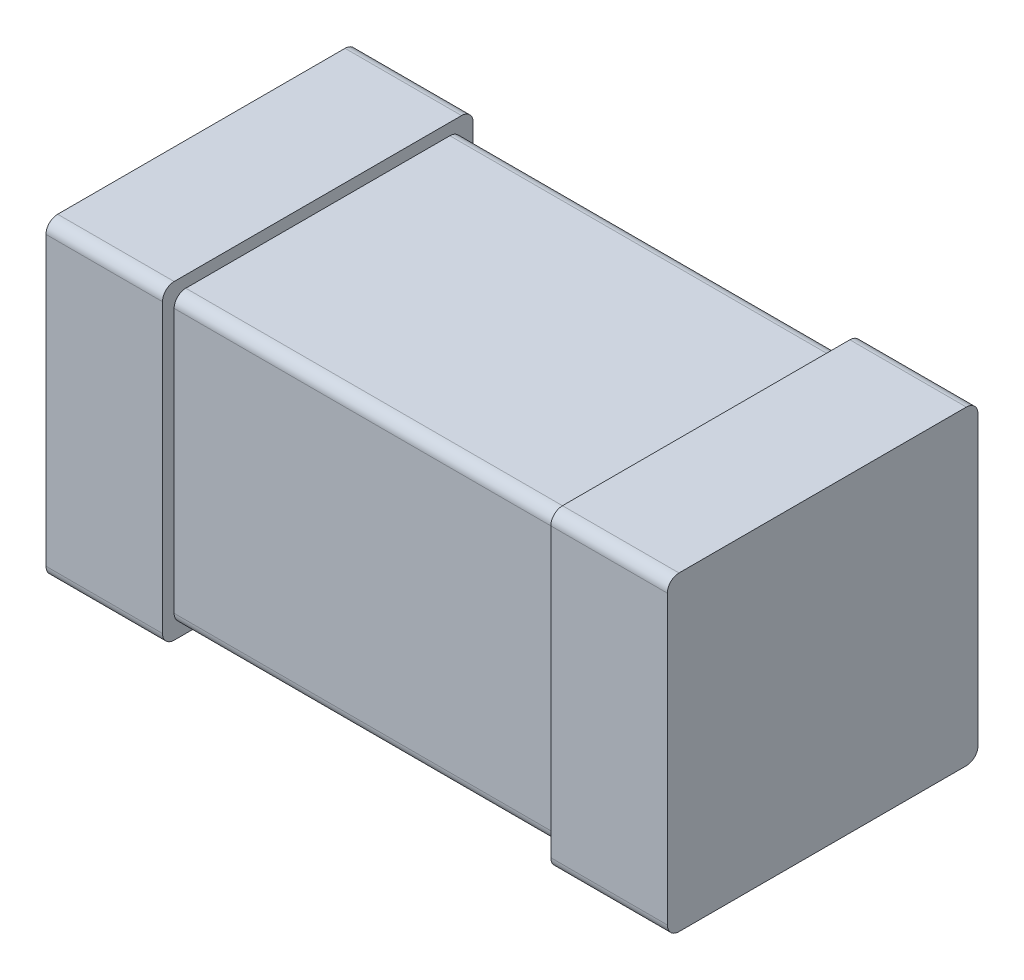
ISO-10303-21;
HEADER;
FILE_DESCRIPTION(('STEP AP214'),'2;1');
FILE_NAME('part.step','',(''),(''),'','','');
FILE_SCHEMA(('AUTOMOTIVE_DESIGN { 1 0 10303 214 1 1 1 1 }'));
ENDSEC;
DATA;
#1=APPLICATION_CONTEXT('core data for automotive mechanical design processes');
#2=APPLICATION_PROTOCOL_DEFINITION('international standard','automotive_design',2000,#1);
#3=PRODUCT_CONTEXT('',#1,'mechanical');
#4=PRODUCT('Part','Part','',(#3));
#5=PRODUCT_RELATED_PRODUCT_CATEGORY('part','',(#4));
#6=PRODUCT_DEFINITION_FORMATION('','',#4);
#7=PRODUCT_DEFINITION_CONTEXT('part definition',#1,'design');
#8=PRODUCT_DEFINITION('design','',#6,#7);
#9=PRODUCT_DEFINITION_SHAPE('','',#8);
#10=(LENGTH_UNIT() NAMED_UNIT(*) SI_UNIT(.MILLI.,.METRE.));
#11=(NAMED_UNIT(*) PLANE_ANGLE_UNIT() SI_UNIT($,.RADIAN.));
#12=(NAMED_UNIT(*) SI_UNIT($,.STERADIAN.) SOLID_ANGLE_UNIT());
#13=UNCERTAINTY_MEASURE_WITH_UNIT(LENGTH_MEASURE(1.E-05),#10,'distance_accuracy_value','');
#14=(GEOMETRIC_REPRESENTATION_CONTEXT(3) GLOBAL_UNCERTAINTY_ASSIGNED_CONTEXT((#13)) GLOBAL_UNIT_ASSIGNED_CONTEXT((#10,
#11,#12)) REPRESENTATION_CONTEXT('',''));
#15=CARTESIAN_POINT('',(0.,0.,0.));
#16=DIRECTION('',(0.,0.,1.));
#17=DIRECTION('',(1.,0.,0.));
#18=AXIS2_PLACEMENT_3D('',#15,#16,#17);
#19=CARTESIAN_POINT('',(0.8,-0.4,0.));
#20=DIRECTION('',(1.,0.,0.));
#21=DIRECTION('',(0.,1.,0.));
#22=AXIS2_PLACEMENT_3D('',#19,#20,#21);
#23=PLANE('',#22);
#24=DIRECTION('',(0.,0.,1.));
#25=VECTOR('',#24,1.);
#26=CARTESIAN_POINT('',(0.8,-0.4,0.));
#27=LINE('',#26,#25);
#28=CARTESIAN_POINT('',(0.8,-0.4,0.03));
#29=VERTEX_POINT('',#28);
#30=CARTESIAN_POINT('',(0.8,-0.4,0.77));
#31=VERTEX_POINT('',#30);
#32=EDGE_CURVE('E373',#29,#31,#27,.T.);
#33=ORIENTED_EDGE('',*,*,#32,.F.);
#34=CARTESIAN_POINT('',(0.8,-0.37,0.03));
#35=DIRECTION('',(1.,0.,0.));
#36=DIRECTION('',(0.,0.,1.));
#37=AXIS2_PLACEMENT_3D('',#34,#35,#36);
#38=CIRCLE('',#37,0.03);
#39=CARTESIAN_POINT('',(0.8,-0.37,0.));
#40=VERTEX_POINT('',#39);
#41=EDGE_CURVE('E440',#29,#40,#38,.T.);
#42=ORIENTED_EDGE('',*,*,#41,.T.);
#43=DIRECTION('',(0.,1.,0.));
#44=VECTOR('',#43,1.);
#45=CARTESIAN_POINT('',(0.8,-0.4,0.));
#46=LINE('',#45,#44);
#47=CARTESIAN_POINT('',(0.8,0.37,0.));
#48=VERTEX_POINT('',#47);
#49=EDGE_CURVE('E401',#40,#48,#46,.T.);
#50=ORIENTED_EDGE('',*,*,#49,.T.);
#51=CARTESIAN_POINT('',(0.8,0.37,0.03));
#52=DIRECTION('',(-1.,0.,0.));
#53=DIRECTION('',(0.,0.,1.));
#54=AXIS2_PLACEMENT_3D('',#51,#52,#53);
#55=CIRCLE('',#54,0.03);
#56=CARTESIAN_POINT('',(0.8,0.4,0.03));
#57=VERTEX_POINT('',#56);
#58=EDGE_CURVE('E298',#57,#48,#55,.T.);
#59=ORIENTED_EDGE('',*,*,#58,.F.);
#60=DIRECTION('',(0.,0.,1.));
#61=VECTOR('',#60,1.);
#62=CARTESIAN_POINT('',(0.8,0.4,0.));
#63=LINE('',#62,#61);
#64=CARTESIAN_POINT('',(0.8,0.4,0.77));
#65=VERTEX_POINT('',#64);
#66=EDGE_CURVE('E11',#57,#65,#63,.T.);
#67=ORIENTED_EDGE('',*,*,#66,.T.);
#68=CARTESIAN_POINT('',(0.8,0.37,0.77));
#69=DIRECTION('',(1.,0.,0.));
#70=DIRECTION('',(0.,0.,1.));
#71=AXIS2_PLACEMENT_3D('',#68,#69,#70);
#72=CIRCLE('',#71,0.03);
#73=CARTESIAN_POINT('',(0.8,0.37,0.8));
#74=VERTEX_POINT('',#73);
#75=EDGE_CURVE('E348',#65,#74,#72,.T.);
#76=ORIENTED_EDGE('',*,*,#75,.T.);
#77=DIRECTION('',(0.,1.,0.));
#78=VECTOR('',#77,1.);
#79=CARTESIAN_POINT('',(0.8,-0.4,0.8));
#80=LINE('',#79,#78);
#81=CARTESIAN_POINT('',(0.8,-0.37,0.8));
#82=VERTEX_POINT('',#81);
#83=EDGE_CURVE('E377',#82,#74,#80,.T.);
#84=ORIENTED_EDGE('',*,*,#83,.F.);
#85=CARTESIAN_POINT('',(0.8,-0.37,0.77));
#86=DIRECTION('',(-1.,0.,0.));
#87=DIRECTION('',(0.,0.,1.));
#88=AXIS2_PLACEMENT_3D('',#85,#86,#87);
#89=CIRCLE('',#88,0.03);
#90=EDGE_CURVE('E237',#31,#82,#89,.T.);
#91=ORIENTED_EDGE('',*,*,#90,.F.);
#92=EDGE_LOOP('',(#33,#42,#50,#59,#67,#76,#84,#91));
#93=FACE_BOUND('',#92,.T.);
#94=ADVANCED_FACE('F17',(#93),#23,.T.);
#95=CARTESIAN_POINT('',(0.5,0.4,0.));
#96=DIRECTION('',(0.,1.,0.));
#97=DIRECTION('',(1.,0.,0.));
#98=AXIS2_PLACEMENT_3D('',#95,#96,#97);
#99=PLANE('',#98);
#100=ORIENTED_EDGE('',*,*,#66,.F.);
#101=DIRECTION('',(1.,0.,0.));
#102=VECTOR('',#101,1.);
#103=CARTESIAN_POINT('',(0.5,0.4,0.03));
#104=LINE('',#103,#102);
#105=CARTESIAN_POINT('',(0.5,0.4,0.03));
#106=VERTEX_POINT('',#105);
#107=EDGE_CURVE('E294',#106,#57,#104,.T.);
#108=ORIENTED_EDGE('',*,*,#107,.F.);
#109=DIRECTION('',(0.,0.,1.));
#110=VECTOR('',#109,1.);
#111=CARTESIAN_POINT('',(0.5,0.4,0.));
#112=LINE('',#111,#110);
#113=CARTESIAN_POINT('',(0.5,0.4,0.77));
#114=VERTEX_POINT('',#113);
#115=EDGE_CURVE('E335',#106,#114,#112,.T.);
#116=ORIENTED_EDGE('',*,*,#115,.T.);
#117=DIRECTION('',(1.,0.,0.));
#118=VECTOR('',#117,1.);
#119=CARTESIAN_POINT('',(0.5,0.4,0.77));
#120=LINE('',#119,#118);
#121=EDGE_CURVE('E28',#114,#65,#120,.T.);
#122=ORIENTED_EDGE('',*,*,#121,.T.);
#123=EDGE_LOOP('',(#100,#108,#116,#122));
#124=FACE_BOUND('',#123,.T.);
#125=ADVANCED_FACE('F630',(#124),#99,.T.);
#126=CARTESIAN_POINT('',(0.5,0.37,0.77));
#127=DIRECTION('',(1.,0.,0.));
#128=DIRECTION('',(0.,1.,0.));
#129=AXIS2_PLACEMENT_3D('',#126,#127,#128);
#130=CYLINDRICAL_SURFACE('',#129,0.03);
#131=CARTESIAN_POINT('',(0.5,0.37,0.77));
#132=DIRECTION('',(1.,0.,0.));
#133=DIRECTION('',(0.,0.,1.));
#134=AXIS2_PLACEMENT_3D('',#131,#132,#133);
#135=CIRCLE('',#134,0.03);
#136=CARTESIAN_POINT('',(0.5,0.37,0.8));
#137=VERTEX_POINT('',#136);
#138=EDGE_CURVE('E339',#114,#137,#135,.T.);
#139=ORIENTED_EDGE('',*,*,#138,.T.);
#140=DIRECTION('',(1.,0.,0.));
#141=VECTOR('',#140,1.);
#142=CARTESIAN_POINT('',(0.5,0.37,0.8));
#143=LINE('',#142,#141);
#144=EDGE_CURVE('E299',#137,#74,#143,.T.);
#145=ORIENTED_EDGE('',*,*,#144,.T.);
#146=ORIENTED_EDGE('',*,*,#75,.F.);
#147=ORIENTED_EDGE('',*,*,#121,.F.);
#148=EDGE_LOOP('',(#139,#145,#146,#147));
#149=FACE_BOUND('',#148,.T.);
#150=ADVANCED_FACE('F646',(#149),#130,.T.);
#151=CARTESIAN_POINT('',(0.5,0.37,0.03));
#152=DIRECTION('',(1.,0.,0.));
#153=DIRECTION('',(0.,1.,0.));
#154=AXIS2_PLACEMENT_3D('',#151,#152,#153);
#155=CYLINDRICAL_SURFACE('',#154,0.03);
#156=ORIENTED_EDGE('',*,*,#107,.T.);
#157=ORIENTED_EDGE('',*,*,#58,.T.);
#158=DIRECTION('',(1.,0.,0.));
#159=VECTOR('',#158,1.);
#160=CARTESIAN_POINT('',(0.5,0.37,0.));
#161=LINE('',#160,#159);
#162=CARTESIAN_POINT('',(0.5,0.37,0.));
#163=VERTEX_POINT('',#162);
#164=EDGE_CURVE('E328',#163,#48,#161,.T.);
#165=ORIENTED_EDGE('',*,*,#164,.F.);
#166=CARTESIAN_POINT('',(0.5,0.37,0.03));
#167=DIRECTION('',(-1.,0.,0.));
#168=DIRECTION('',(0.,0.,1.));
#169=AXIS2_PLACEMENT_3D('',#166,#167,#168);
#170=CIRCLE('',#169,0.03);
#171=EDGE_CURVE('E311',#106,#163,#170,.T.);
#172=ORIENTED_EDGE('',*,*,#171,.F.);
#173=EDGE_LOOP('',(#156,#157,#165,#172));
#174=FACE_BOUND('',#173,.T.);
#175=ADVANCED_FACE('F555',(#174),#155,.T.);
#176=CARTESIAN_POINT('',(0.5,-0.4,0.8));
#177=DIRECTION('',(0.,0.,1.));
#178=DIRECTION('',(1.,0.,0.));
#179=AXIS2_PLACEMENT_3D('',#176,#177,#178);
#180=PLANE('',#179);
#181=DIRECTION('',(0.,1.,0.));
#182=VECTOR('',#181,1.);
#183=CARTESIAN_POINT('',(0.5,-0.4,0.8));
#184=LINE('',#183,#182);
#185=CARTESIAN_POINT('',(0.5,-0.37,0.8));
#186=VERTEX_POINT('',#185);
#187=EDGE_CURVE('E250',#186,#137,#184,.T.);
#188=ORIENTED_EDGE('',*,*,#187,.F.);
#189=DIRECTION('',(1.,0.,0.));
#190=VECTOR('',#189,1.);
#191=CARTESIAN_POINT('',(0.5,-0.37,0.8));
#192=LINE('',#191,#190);
#193=EDGE_CURVE('E324',#186,#82,#192,.T.);
#194=ORIENTED_EDGE('',*,*,#193,.T.);
#195=ORIENTED_EDGE('',*,*,#83,.T.);
#196=ORIENTED_EDGE('',*,*,#144,.F.);
#197=EDGE_LOOP('',(#188,#194,#195,#196));
#198=FACE_BOUND('',#197,.T.);
#199=ADVANCED_FACE('F549',(#198),#180,.T.);
#200=CARTESIAN_POINT('',(0.5,-0.4,0.));
#201=DIRECTION('',(0.,0.,1.));
#202=DIRECTION('',(1.,0.,0.));
#203=AXIS2_PLACEMENT_3D('',#200,#201,#202);
#204=PLANE('',#203);
#205=ORIENTED_EDGE('',*,*,#164,.T.);
#206=ORIENTED_EDGE('',*,*,#49,.F.);
#207=DIRECTION('',(1.,0.,0.));
#208=VECTOR('',#207,1.);
#209=CARTESIAN_POINT('',(0.5,-0.37,0.));
#210=LINE('',#209,#208);
#211=CARTESIAN_POINT('',(0.5,-0.37,0.));
#212=VERTEX_POINT('',#211);
#213=EDGE_CURVE('E444',#212,#40,#210,.T.);
#214=ORIENTED_EDGE('',*,*,#213,.F.);
#215=DIRECTION('',(0.,1.,0.));
#216=VECTOR('',#215,1.);
#217=CARTESIAN_POINT('',(0.5,-0.4,0.));
#218=LINE('',#217,#216);
#219=EDGE_CURVE('E306',#212,#163,#218,.T.);
#220=ORIENTED_EDGE('',*,*,#219,.T.);
#221=EDGE_LOOP('',(#205,#206,#214,#220));
#222=FACE_BOUND('',#221,.T.);
#223=ADVANCED_FACE('F554',(#222),#204,.F.);
#224=CARTESIAN_POINT('',(0.5,-0.37,0.77));
#225=DIRECTION('',(1.,0.,0.));
#226=DIRECTION('',(0.,-1.,0.));
#227=AXIS2_PLACEMENT_3D('',#224,#225,#226);
#228=CYLINDRICAL_SURFACE('',#227,0.03);
#229=DIRECTION('',(1.,0.,0.));
#230=VECTOR('',#229,1.);
#231=CARTESIAN_POINT('',(0.5,-0.4,0.77));
#232=LINE('',#231,#230);
#233=CARTESIAN_POINT('',(0.5,-0.4,0.77));
#234=VERTEX_POINT('',#233);
#235=EDGE_CURVE('E359',#234,#31,#232,.T.);
#236=ORIENTED_EDGE('',*,*,#235,.T.);
#237=ORIENTED_EDGE('',*,*,#90,.T.);
#238=ORIENTED_EDGE('',*,*,#193,.F.);
#239=CARTESIAN_POINT('',(0.5,-0.37,0.77));
#240=DIRECTION('',(-1.,0.,0.));
#241=DIRECTION('',(0.,0.,1.));
#242=AXIS2_PLACEMENT_3D('',#239,#240,#241);
#243=CIRCLE('',#242,0.03);
#244=EDGE_CURVE('E209',#234,#186,#243,.T.);
#245=ORIENTED_EDGE('',*,*,#244,.F.);
#246=EDGE_LOOP('',(#236,#237,#238,#245));
#247=FACE_BOUND('',#246,.T.);
#248=ADVANCED_FACE('F618',(#247),#228,.T.);
#249=CARTESIAN_POINT('',(0.5,-0.37,0.03));
#250=DIRECTION('',(1.,0.,0.));
#251=DIRECTION('',(0.,-1.,0.));
#252=AXIS2_PLACEMENT_3D('',#249,#250,#251);
#253=CYLINDRICAL_SURFACE('',#252,0.03);
#254=CARTESIAN_POINT('',(0.5,-0.37,0.03));
#255=DIRECTION('',(1.,0.,0.));
#256=DIRECTION('',(0.,0.,1.));
#257=AXIS2_PLACEMENT_3D('',#254,#255,#256);
#258=CIRCLE('',#257,0.03);
#259=CARTESIAN_POINT('',(0.5,-0.4,0.03));
#260=VERTEX_POINT('',#259);
#261=EDGE_CURVE('E310',#260,#212,#258,.T.);
#262=ORIENTED_EDGE('',*,*,#261,.T.);
#263=ORIENTED_EDGE('',*,*,#213,.T.);
#264=ORIENTED_EDGE('',*,*,#41,.F.);
#265=DIRECTION('',(1.,0.,0.));
#266=VECTOR('',#265,1.);
#267=CARTESIAN_POINT('',(0.5,-0.4,0.03));
#268=LINE('',#267,#266);
#269=EDGE_CURVE('E369',#260,#29,#268,.T.);
#270=ORIENTED_EDGE('',*,*,#269,.F.);
#271=EDGE_LOOP('',(#262,#263,#264,#270));
#272=FACE_BOUND('',#271,.T.);
#273=ADVANCED_FACE('F612',(#272),#253,.T.);
#274=CARTESIAN_POINT('',(0.5,-0.4,0.));
#275=DIRECTION('',(0.,1.,0.));
#276=DIRECTION('',(1.,0.,0.));
#277=AXIS2_PLACEMENT_3D('',#274,#275,#276);
#278=PLANE('',#277);
#279=ORIENTED_EDGE('',*,*,#235,.F.);
#280=DIRECTION('',(0.,0.,1.));
#281=VECTOR('',#280,1.);
#282=CARTESIAN_POINT('',(0.5,-0.4,0.));
#283=LINE('',#282,#281);
#284=EDGE_CURVE('E323',#260,#234,#283,.T.);
#285=ORIENTED_EDGE('',*,*,#284,.F.);
#286=ORIENTED_EDGE('',*,*,#269,.T.);
#287=ORIENTED_EDGE('',*,*,#32,.T.);
#288=EDGE_LOOP('',(#279,#285,#286,#287));
#289=FACE_BOUND('',#288,.T.);
#290=ADVANCED_FACE('F617',(#289),#278,.F.);
#291=CARTESIAN_POINT('',(0.5,-0.4,0.));
#292=DIRECTION('',(1.,0.,0.));
#293=DIRECTION('',(0.,1.,0.));
#294=AXIS2_PLACEMENT_3D('',#291,#292,#293);
#295=PLANE('',#294);
#296=DIRECTION('',(0.,1.,0.));
#297=VECTOR('',#296,1.);
#298=CARTESIAN_POINT('',(0.5,-0.37,0.03));
#299=LINE('',#298,#297);
#300=CARTESIAN_POINT('',(0.5,-0.34,0.03));
#301=VERTEX_POINT('',#300);
#302=CARTESIAN_POINT('',(0.5,0.34,0.03));
#303=VERTEX_POINT('',#302);
#304=EDGE_CURVE('E394',#301,#303,#299,.T.);
#305=ORIENTED_EDGE('',*,*,#304,.T.);
#306=CARTESIAN_POINT('',(0.5,0.34,0.06));
#307=DIRECTION('',(-1.,0.,0.));
#308=DIRECTION('',(0.,0.,1.));
#309=AXIS2_PLACEMENT_3D('',#306,#307,#308);
#310=CIRCLE('',#309,0.03);
#311=CARTESIAN_POINT('',(0.5,0.37,0.06));
#312=VERTEX_POINT('',#311);
#313=EDGE_CURVE('E384',#312,#303,#310,.T.);
#314=ORIENTED_EDGE('',*,*,#313,.F.);
#315=DIRECTION('',(0.,0.,1.));
#316=VECTOR('',#315,1.);
#317=CARTESIAN_POINT('',(0.5,0.37,0.03));
#318=LINE('',#317,#316);
#319=CARTESIAN_POINT('',(0.5,0.37,0.74));
#320=VERTEX_POINT('',#319);
#321=EDGE_CURVE('E256',#312,#320,#318,.T.);
#322=ORIENTED_EDGE('',*,*,#321,.T.);
#323=CARTESIAN_POINT('',(0.5,0.34,0.74));
#324=DIRECTION('',(1.,0.,0.));
#325=DIRECTION('',(0.,0.,1.));
#326=AXIS2_PLACEMENT_3D('',#323,#324,#325);
#327=CIRCLE('',#326,0.03);
#328=CARTESIAN_POINT('',(0.5,0.34,0.77));
#329=VERTEX_POINT('',#328);
#330=EDGE_CURVE('E240',#320,#329,#327,.T.);
#331=ORIENTED_EDGE('',*,*,#330,.T.);
#332=DIRECTION('',(0.,1.,0.));
#333=VECTOR('',#332,1.);
#334=CARTESIAN_POINT('',(0.5,-0.37,0.77));
#335=LINE('',#334,#333);
#336=CARTESIAN_POINT('',(0.5,-0.34,0.77));
#337=VERTEX_POINT('',#336);
#338=EDGE_CURVE('E217',#337,#329,#335,.T.);
#339=ORIENTED_EDGE('',*,*,#338,.F.);
#340=CARTESIAN_POINT('',(0.5,-0.34,0.74));
#341=DIRECTION('',(-1.,0.,0.));
#342=DIRECTION('',(0.,0.,1.));
#343=AXIS2_PLACEMENT_3D('',#340,#341,#342);
#344=CIRCLE('',#343,0.03);
#345=CARTESIAN_POINT('',(0.5,-0.37,0.74));
#346=VERTEX_POINT('',#345);
#347=EDGE_CURVE('E210',#346,#337,#344,.T.);
#348=ORIENTED_EDGE('',*,*,#347,.F.);
#349=DIRECTION('',(0.,0.,1.));
#350=VECTOR('',#349,1.);
#351=CARTESIAN_POINT('',(0.5,-0.37,0.03));
#352=LINE('',#351,#350);
#353=CARTESIAN_POINT('',(0.5,-0.37,0.06));
#354=VERTEX_POINT('',#353);
#355=EDGE_CURVE('E197',#354,#346,#352,.T.);
#356=ORIENTED_EDGE('',*,*,#355,.F.);
#357=CARTESIAN_POINT('',(0.5,-0.34,0.06));
#358=DIRECTION('',(1.,0.,0.));
#359=DIRECTION('',(0.,0.,1.));
#360=AXIS2_PLACEMENT_3D('',#357,#358,#359);
#361=CIRCLE('',#360,0.03);
#362=EDGE_CURVE('E21',#354,#301,#361,.T.);
#363=ORIENTED_EDGE('',*,*,#362,.T.);
#364=EDGE_LOOP('',(#305,#314,#322,#331,#339,#348,#356,#363));
#365=FACE_BOUND('',#364,.T.);
#366=ORIENTED_EDGE('',*,*,#244,.T.);
#367=ORIENTED_EDGE('',*,*,#187,.T.);
#368=ORIENTED_EDGE('',*,*,#138,.F.);
#369=ORIENTED_EDGE('',*,*,#115,.F.);
#370=ORIENTED_EDGE('',*,*,#171,.T.);
#371=ORIENTED_EDGE('',*,*,#219,.F.);
#372=ORIENTED_EDGE('',*,*,#261,.F.);
#373=ORIENTED_EDGE('',*,*,#284,.T.);
#374=EDGE_LOOP('',(#366,#367,#368,#369,#370,#371,#372,#373));
#375=FACE_BOUND('',#374,.T.);
#376=ADVANCED_FACE('F214',(#365,#375),#295,.F.);
#377=CARTESIAN_POINT('',(-0.5,-0.37,0.03));
#378=DIRECTION('',(0.,1.,0.));
#379=DIRECTION('',(1.,0.,0.));
#380=AXIS2_PLACEMENT_3D('',#377,#378,#379);
#381=PLANE('',#380);
#382=DIRECTION('',(1.,0.,0.));
#383=VECTOR('',#382,1.);
#384=CARTESIAN_POINT('',(-0.5,-0.37,0.74));
#385=LINE('',#384,#383);
#386=CARTESIAN_POINT('',(-0.5,-0.37,0.74));
#387=VERTEX_POINT('',#386);
#388=EDGE_CURVE('E202',#387,#346,#385,.T.);
#389=ORIENTED_EDGE('',*,*,#388,.F.);
#390=DIRECTION('',(0.,0.,1.));
#391=VECTOR('',#390,1.);
#392=CARTESIAN_POINT('',(-0.5,-0.37,0.03));
#393=LINE('',#392,#391);
#394=CARTESIAN_POINT('',(-0.5,-0.37,0.06));
#395=VERTEX_POINT('',#394);
#396=EDGE_CURVE('E278',#395,#387,#393,.T.);
#397=ORIENTED_EDGE('',*,*,#396,.F.);
#398=DIRECTION('',(1.,0.,0.));
#399=VECTOR('',#398,1.);
#400=CARTESIAN_POINT('',(-0.5,-0.37,0.06));
#401=LINE('',#400,#399);
#402=EDGE_CURVE('E204',#395,#354,#401,.T.);
#403=ORIENTED_EDGE('',*,*,#402,.T.);
#404=ORIENTED_EDGE('',*,*,#355,.T.);
#405=EDGE_LOOP('',(#389,#397,#403,#404));
#406=FACE_BOUND('',#405,.T.);
#407=ADVANCED_FACE('F199',(#406),#381,.F.);
#408=CARTESIAN_POINT('',(-0.5,-0.34,0.74));
#409=DIRECTION('',(1.,0.,0.));
#410=DIRECTION('',(0.,-1.,0.));
#411=AXIS2_PLACEMENT_3D('',#408,#409,#410);
#412=CYLINDRICAL_SURFACE('',#411,0.03);
#413=ORIENTED_EDGE('',*,*,#388,.T.);
#414=ORIENTED_EDGE('',*,*,#347,.T.);
#415=DIRECTION('',(1.,0.,0.));
#416=VECTOR('',#415,1.);
#417=CARTESIAN_POINT('',(-0.5,-0.34,0.77));
#418=LINE('',#417,#416);
#419=CARTESIAN_POINT('',(-0.5,-0.34,0.77));
#420=VERTEX_POINT('',#419);
#421=EDGE_CURVE('E233',#420,#337,#418,.T.);
#422=ORIENTED_EDGE('',*,*,#421,.F.);
#423=CARTESIAN_POINT('',(-0.5,-0.34,0.74));
#424=DIRECTION('',(-1.,0.,0.));
#425=DIRECTION('',(0.,0.,1.));
#426=AXIS2_PLACEMENT_3D('',#423,#424,#425);
#427=CIRCLE('',#426,0.03);
#428=EDGE_CURVE('E225',#387,#420,#427,.T.);
#429=ORIENTED_EDGE('',*,*,#428,.F.);
#430=EDGE_LOOP('',(#413,#414,#422,#429));
#431=FACE_BOUND('',#430,.T.);
#432=ADVANCED_FACE('F223',(#431),#412,.T.);
#433=CARTESIAN_POINT('',(-0.5,-0.37,0.77));
#434=DIRECTION('',(0.,0.,1.));
#435=DIRECTION('',(1.,0.,0.));
#436=AXIS2_PLACEMENT_3D('',#433,#434,#435);
#437=PLANE('',#436);
#438=DIRECTION('',(0.,1.,0.));
#439=VECTOR('',#438,1.);
#440=CARTESIAN_POINT('',(-0.5,-0.37,0.77));
#441=LINE('',#440,#439);
#442=CARTESIAN_POINT('',(-0.5,0.34,0.77));
#443=VERTEX_POINT('',#442);
#444=EDGE_CURVE('E273',#420,#443,#441,.T.);
#445=ORIENTED_EDGE('',*,*,#444,.F.);
#446=ORIENTED_EDGE('',*,*,#421,.T.);
#447=ORIENTED_EDGE('',*,*,#338,.T.);
#448=DIRECTION('',(1.,0.,0.));
#449=VECTOR('',#448,1.);
#450=CARTESIAN_POINT('',(-0.5,0.34,0.77));
#451=LINE('',#450,#449);
#452=EDGE_CURVE('E255',#443,#329,#451,.T.);
#453=ORIENTED_EDGE('',*,*,#452,.F.);
#454=EDGE_LOOP('',(#445,#446,#447,#453));
#455=FACE_BOUND('',#454,.T.);
#456=ADVANCED_FACE('F653',(#455),#437,.T.);
#457=CARTESIAN_POINT('',(-0.5,0.34,0.74));
#458=DIRECTION('',(1.,0.,0.));
#459=DIRECTION('',(0.,1.,0.));
#460=AXIS2_PLACEMENT_3D('',#457,#458,#459);
#461=CYLINDRICAL_SURFACE('',#460,0.03);
#462=CARTESIAN_POINT('',(-0.5,0.34,0.74));
#463=DIRECTION('',(1.,0.,0.));
#464=DIRECTION('',(0.,0.,1.));
#465=AXIS2_PLACEMENT_3D('',#462,#463,#464);
#466=CIRCLE('',#465,0.03);
#467=CARTESIAN_POINT('',(-0.5,0.37,0.74));
#468=VERTEX_POINT('',#467);
#469=EDGE_CURVE('E269',#468,#443,#466,.T.);
#470=ORIENTED_EDGE('',*,*,#469,.T.);
#471=ORIENTED_EDGE('',*,*,#452,.T.);
#472=ORIENTED_EDGE('',*,*,#330,.F.);
#473=DIRECTION('',(1.,0.,0.));
#474=VECTOR('',#473,1.);
#475=CARTESIAN_POINT('',(-0.5,0.37,0.74));
#476=LINE('',#475,#474);
#477=EDGE_CURVE('E251',#468,#320,#476,.T.);
#478=ORIENTED_EDGE('',*,*,#477,.F.);
#479=EDGE_LOOP('',(#470,#471,#472,#478));
#480=FACE_BOUND('',#479,.T.);
#481=ADVANCED_FACE('F658',(#480),#461,.T.);
#482=CARTESIAN_POINT('',(-0.5,0.37,0.03));
#483=DIRECTION('',(0.,1.,0.));
#484=DIRECTION('',(1.,0.,0.));
#485=AXIS2_PLACEMENT_3D('',#482,#483,#484);
#486=PLANE('',#485);
#487=ORIENTED_EDGE('',*,*,#321,.F.);
#488=DIRECTION('',(1.,0.,0.));
#489=VECTOR('',#488,1.);
#490=CARTESIAN_POINT('',(-0.5,0.37,0.06));
#491=LINE('',#490,#489);
#492=CARTESIAN_POINT('',(-0.5,0.37,0.06));
#493=VERTEX_POINT('',#492);
#494=EDGE_CURVE('E395',#493,#312,#491,.T.);
#495=ORIENTED_EDGE('',*,*,#494,.F.);
#496=DIRECTION('',(0.,0.,1.));
#497=VECTOR('',#496,1.);
#498=CARTESIAN_POINT('',(-0.5,0.37,0.03));
#499=LINE('',#498,#497);
#500=EDGE_CURVE('E268',#493,#468,#499,.T.);
#501=ORIENTED_EDGE('',*,*,#500,.T.);
#502=ORIENTED_EDGE('',*,*,#477,.T.);
#503=EDGE_LOOP('',(#487,#495,#501,#502));
#504=FACE_BOUND('',#503,.T.);
#505=ADVANCED_FACE('F738',(#504),#486,.T.);
#506=CARTESIAN_POINT('',(-0.5,0.34,0.06));
#507=DIRECTION('',(1.,0.,0.));
#508=DIRECTION('',(0.,1.,0.));
#509=AXIS2_PLACEMENT_3D('',#506,#507,#508);
#510=CYLINDRICAL_SURFACE('',#509,0.03);
#511=ORIENTED_EDGE('',*,*,#494,.T.);
#512=ORIENTED_EDGE('',*,*,#313,.T.);
#513=DIRECTION('',(1.,0.,0.));
#514=VECTOR('',#513,1.);
#515=CARTESIAN_POINT('',(-0.5,0.34,0.03));
#516=LINE('',#515,#514);
#517=CARTESIAN_POINT('',(-0.5,0.34,0.03));
#518=VERTEX_POINT('',#517);
#519=EDGE_CURVE('E390',#518,#303,#516,.T.);
#520=ORIENTED_EDGE('',*,*,#519,.F.);
#521=CARTESIAN_POINT('',(-0.5,0.34,0.06));
#522=DIRECTION('',(-1.,0.,0.));
#523=DIRECTION('',(0.,0.,1.));
#524=AXIS2_PLACEMENT_3D('',#521,#522,#523);
#525=CIRCLE('',#524,0.03);
#526=EDGE_CURVE('E263',#493,#518,#525,.T.);
#527=ORIENTED_EDGE('',*,*,#526,.F.);
#528=EDGE_LOOP('',(#511,#512,#520,#527));
#529=FACE_BOUND('',#528,.T.);
#530=ADVANCED_FACE('F604',(#529),#510,.T.);
#531=CARTESIAN_POINT('',(-0.5,-0.37,0.03));
#532=DIRECTION('',(0.,0.,1.));
#533=DIRECTION('',(1.,0.,0.));
#534=AXIS2_PLACEMENT_3D('',#531,#532,#533);
#535=PLANE('',#534);
#536=ORIENTED_EDGE('',*,*,#519,.T.);
#537=ORIENTED_EDGE('',*,*,#304,.F.);
#538=DIRECTION('',(1.,0.,0.));
#539=VECTOR('',#538,1.);
#540=CARTESIAN_POINT('',(-0.5,-0.34,0.03));
#541=LINE('',#540,#539);
#542=CARTESIAN_POINT('',(-0.5,-0.34,0.03));
#543=VERTEX_POINT('',#542);
#544=EDGE_CURVE('E319',#543,#301,#541,.T.);
#545=ORIENTED_EDGE('',*,*,#544,.F.);
#546=DIRECTION('',(0.,1.,0.));
#547=VECTOR('',#546,1.);
#548=CARTESIAN_POINT('',(-0.5,-0.37,0.03));
#549=LINE('',#548,#547);
#550=EDGE_CURVE('E267',#543,#518,#549,.T.);
#551=ORIENTED_EDGE('',*,*,#550,.T.);
#552=EDGE_LOOP('',(#536,#537,#545,#551));
#553=FACE_BOUND('',#552,.T.);
#554=ADVANCED_FACE('F598',(#553),#535,.F.);
#555=CARTESIAN_POINT('',(-0.5,-0.34,0.06));
#556=DIRECTION('',(1.,0.,0.));
#557=DIRECTION('',(0.,-1.,0.));
#558=AXIS2_PLACEMENT_3D('',#555,#556,#557);
#559=CYLINDRICAL_SURFACE('',#558,0.03);
#560=CARTESIAN_POINT('',(-0.5,-0.34,0.06));
#561=DIRECTION('',(1.,0.,0.));
#562=DIRECTION('',(0.,0.,1.));
#563=AXIS2_PLACEMENT_3D('',#560,#561,#562);
#564=CIRCLE('',#563,0.03);
#565=EDGE_CURVE('E274',#395,#543,#564,.T.);
#566=ORIENTED_EDGE('',*,*,#565,.T.);
#567=ORIENTED_EDGE('',*,*,#544,.T.);
#568=ORIENTED_EDGE('',*,*,#362,.F.);
#569=ORIENTED_EDGE('',*,*,#402,.F.);
#570=EDGE_LOOP('',(#566,#567,#568,#569));
#571=FACE_BOUND('',#570,.T.);
#572=ADVANCED_FACE('F603',(#571),#559,.T.);
#573=CARTESIAN_POINT('',(-0.5,-0.4,0.));
#574=DIRECTION('',(1.,0.,0.));
#575=DIRECTION('',(0.,1.,0.));
#576=AXIS2_PLACEMENT_3D('',#573,#574,#575);
#577=PLANE('',#576);
#578=ORIENTED_EDGE('',*,*,#565,.F.);
#579=ORIENTED_EDGE('',*,*,#396,.T.);
#580=ORIENTED_EDGE('',*,*,#428,.T.);
#581=ORIENTED_EDGE('',*,*,#444,.T.);
#582=ORIENTED_EDGE('',*,*,#469,.F.);
#583=ORIENTED_EDGE('',*,*,#500,.F.);
#584=ORIENTED_EDGE('',*,*,#526,.T.);
#585=ORIENTED_EDGE('',*,*,#550,.F.);
#586=EDGE_LOOP('',(#578,#579,#580,#581,#582,#583,#584,#585));
#587=FACE_BOUND('',#586,.T.);
#588=DIRECTION('',(0.,0.,1.));
#589=VECTOR('',#588,1.);
#590=CARTESIAN_POINT('',(-0.5,-0.4,0.));
#591=LINE('',#590,#589);
#592=CARTESIAN_POINT('',(-0.5,-0.4,0.03));
#593=VERTEX_POINT('',#592);
#594=CARTESIAN_POINT('',(-0.5,-0.4,0.77));
#595=VERTEX_POINT('',#594);
#596=EDGE_CURVE('E353',#593,#595,#591,.T.);
#597=ORIENTED_EDGE('',*,*,#596,.F.);
#598=CARTESIAN_POINT('',(-0.5,-0.37,0.03));
#599=DIRECTION('',(1.,0.,0.));
#600=DIRECTION('',(0.,0.,1.));
#601=AXIS2_PLACEMENT_3D('',#598,#599,#600);
#602=CIRCLE('',#601,0.03);
#603=CARTESIAN_POINT('',(-0.5,-0.37,0.));
#604=VERTEX_POINT('',#603);
#605=EDGE_CURVE('E315',#593,#604,#602,.T.);
#606=ORIENTED_EDGE('',*,*,#605,.T.);
#607=DIRECTION('',(0.,1.,0.));
#608=VECTOR('',#607,1.);
#609=CARTESIAN_POINT('',(-0.5,-0.4,0.));
#610=LINE('',#609,#608);
#611=CARTESIAN_POINT('',(-0.5,0.37,0.));
#612=VERTEX_POINT('',#611);
#613=EDGE_CURVE('E246',#604,#612,#610,.T.);
#614=ORIENTED_EDGE('',*,*,#613,.T.);
#615=CARTESIAN_POINT('',(-0.5,0.37,0.03));
#616=DIRECTION('',(-1.,0.,0.));
#617=DIRECTION('',(0.,0.,1.));
#618=AXIS2_PLACEMENT_3D('',#615,#616,#617);
#619=CIRCLE('',#618,0.03);
#620=CARTESIAN_POINT('',(-0.5,0.4,0.03));
#621=VERTEX_POINT('',#620);
#622=EDGE_CURVE('E290',#621,#612,#619,.T.);
#623=ORIENTED_EDGE('',*,*,#622,.F.);
#624=DIRECTION('',(0.,0.,1.));
#625=VECTOR('',#624,1.);
#626=CARTESIAN_POINT('',(-0.5,0.4,0.));
#627=LINE('',#626,#625);
#628=CARTESIAN_POINT('',(-0.5,0.4,0.77));
#629=VERTEX_POINT('',#628);
#630=EDGE_CURVE('E279',#621,#629,#627,.T.);
#631=ORIENTED_EDGE('',*,*,#630,.T.);
#632=CARTESIAN_POINT('',(-0.5,0.37,0.77));
#633=DIRECTION('',(1.,0.,0.));
#634=DIRECTION('',(0.,0.,1.));
#635=AXIS2_PLACEMENT_3D('',#632,#633,#634);
#636=CIRCLE('',#635,0.03);
#637=CARTESIAN_POINT('',(-0.5,0.37,0.8));
#638=VERTEX_POINT('',#637);
#639=EDGE_CURVE('E285',#629,#638,#636,.T.);
#640=ORIENTED_EDGE('',*,*,#639,.T.);
#641=DIRECTION('',(0.,1.,0.));
#642=VECTOR('',#641,1.);
#643=CARTESIAN_POINT('',(-0.5,-0.4,0.8));
#644=LINE('',#643,#642);
#645=CARTESIAN_POINT('',(-0.5,-0.37,0.8));
#646=VERTEX_POINT('',#645);
#647=EDGE_CURVE('E241',#646,#638,#644,.T.);
#648=ORIENTED_EDGE('',*,*,#647,.F.);
#649=CARTESIAN_POINT('',(-0.5,-0.37,0.77));
#650=DIRECTION('',(-1.,0.,0.));
#651=DIRECTION('',(0.,0.,1.));
#652=AXIS2_PLACEMENT_3D('',#649,#650,#651);
#653=CIRCLE('',#652,0.03);
#654=EDGE_CURVE('E305',#595,#646,#653,.T.);
#655=ORIENTED_EDGE('',*,*,#654,.F.);
#656=EDGE_LOOP('',(#597,#606,#614,#623,#631,#640,#648,#655));
#657=FACE_BOUND('',#656,.T.);
#658=ADVANCED_FACE('F472',(#587,#657),#577,.T.);
#659=CARTESIAN_POINT('',(-0.8,0.4,0.));
#660=DIRECTION('',(0.,1.,0.));
#661=DIRECTION('',(1.,0.,0.));
#662=AXIS2_PLACEMENT_3D('',#659,#660,#661);
#663=PLANE('',#662);
#664=ORIENTED_EDGE('',*,*,#630,.F.);
#665=DIRECTION('',(1.,0.,0.));
#666=VECTOR('',#665,1.);
#667=CARTESIAN_POINT('',(-0.8,0.4,0.03));
#668=LINE('',#667,#666);
#669=CARTESIAN_POINT('',(-0.8,0.4,0.03));
#670=VERTEX_POINT('',#669);
#671=EDGE_CURVE('E293',#670,#621,#668,.T.);
#672=ORIENTED_EDGE('',*,*,#671,.F.);
#673=DIRECTION('',(0.,0.,1.));
#674=VECTOR('',#673,1.);
#675=CARTESIAN_POINT('',(-0.8,0.4,0.));
#676=LINE('',#675,#674);
#677=CARTESIAN_POINT('',(-0.8,0.4,0.77));
#678=VERTEX_POINT('',#677);
#679=EDGE_CURVE('E262',#670,#678,#676,.T.);
#680=ORIENTED_EDGE('',*,*,#679,.T.);
#681=DIRECTION('',(1.,0.,0.));
#682=VECTOR('',#681,1.);
#683=CARTESIAN_POINT('',(-0.8,0.4,0.77));
#684=LINE('',#683,#682);
#685=EDGE_CURVE('E289',#678,#629,#684,.T.);
#686=ORIENTED_EDGE('',*,*,#685,.T.);
#687=EDGE_LOOP('',(#664,#672,#680,#686));
#688=FACE_BOUND('',#687,.T.);
#689=ADVANCED_FACE('F538',(#688),#663,.T.);
#690=CARTESIAN_POINT('',(-0.8,0.37,0.77));
#691=DIRECTION('',(1.,0.,0.));
#692=DIRECTION('',(0.,1.,0.));
#693=AXIS2_PLACEMENT_3D('',#690,#691,#692);
#694=CYLINDRICAL_SURFACE('',#693,0.03);
#695=CARTESIAN_POINT('',(-0.8,0.37,0.77));
#696=DIRECTION('',(1.,0.,0.));
#697=DIRECTION('',(0.,0.,1.));
#698=AXIS2_PLACEMENT_3D('',#695,#696,#697);
#699=CIRCLE('',#698,0.03);
#700=CARTESIAN_POINT('',(-0.8,0.37,0.8));
#701=VERTEX_POINT('',#700);
#702=EDGE_CURVE('E280',#678,#701,#699,.T.);
#703=ORIENTED_EDGE('',*,*,#702,.T.);
#704=DIRECTION('',(1.,0.,0.));
#705=VECTOR('',#704,1.);
#706=CARTESIAN_POINT('',(-0.8,0.37,0.8));
#707=LINE('',#706,#705);
#708=EDGE_CURVE('E245',#701,#638,#707,.T.);
#709=ORIENTED_EDGE('',*,*,#708,.T.);
#710=ORIENTED_EDGE('',*,*,#639,.F.);
#711=ORIENTED_EDGE('',*,*,#685,.F.);
#712=EDGE_LOOP('',(#703,#709,#710,#711));
#713=FACE_BOUND('',#712,.T.);
#714=ADVANCED_FACE('F520',(#713),#694,.T.);
#715=CARTESIAN_POINT('',(-0.8,0.37,0.03));
#716=DIRECTION('',(1.,0.,0.));
#717=DIRECTION('',(0.,1.,0.));
#718=AXIS2_PLACEMENT_3D('',#715,#716,#717);
#719=CYLINDRICAL_SURFACE('',#718,0.03);
#720=ORIENTED_EDGE('',*,*,#671,.T.);
#721=ORIENTED_EDGE('',*,*,#622,.T.);
#722=DIRECTION('',(1.,0.,0.));
#723=VECTOR('',#722,1.);
#724=CARTESIAN_POINT('',(-0.8,0.37,0.));
#725=LINE('',#724,#723);
#726=CARTESIAN_POINT('',(-0.8,0.37,0.));
#727=VERTEX_POINT('',#726);
#728=EDGE_CURVE('E304',#727,#612,#725,.T.);
#729=ORIENTED_EDGE('',*,*,#728,.F.);
#730=CARTESIAN_POINT('',(-0.8,0.37,0.03));
#731=DIRECTION('',(-1.,0.,0.));
#732=DIRECTION('',(0.,0.,1.));
#733=AXIS2_PLACEMENT_3D('',#730,#731,#732);
#734=CIRCLE('',#733,0.03);
#735=EDGE_CURVE('E257',#670,#727,#734,.T.);
#736=ORIENTED_EDGE('',*,*,#735,.F.);
#737=EDGE_LOOP('',(#720,#721,#729,#736));
#738=FACE_BOUND('',#737,.T.);
#739=ADVANCED_FACE('F19',(#738),#719,.T.);
#740=CARTESIAN_POINT('',(-0.8,-0.4,0.8));
#741=DIRECTION('',(0.,0.,1.));
#742=DIRECTION('',(1.,0.,0.));
#743=AXIS2_PLACEMENT_3D('',#740,#741,#742);
#744=PLANE('',#743);
#745=DIRECTION('',(0.,1.,0.));
#746=VECTOR('',#745,1.);
#747=CARTESIAN_POINT('',(-0.8,-0.4,0.8));
#748=LINE('',#747,#746);
#749=CARTESIAN_POINT('',(-0.8,-0.37,0.8));
#750=VERTEX_POINT('',#749);
#751=EDGE_CURVE('E284',#750,#701,#748,.T.);
#752=ORIENTED_EDGE('',*,*,#751,.F.);
#753=DIRECTION('',(1.,0.,0.));
#754=VECTOR('',#753,1.);
#755=CARTESIAN_POINT('',(-0.8,-0.37,0.8));
#756=LINE('',#755,#754);
#757=EDGE_CURVE('E300',#750,#646,#756,.T.);
#758=ORIENTED_EDGE('',*,*,#757,.T.);
#759=ORIENTED_EDGE('',*,*,#647,.T.);
#760=ORIENTED_EDGE('',*,*,#708,.F.);
#761=EDGE_LOOP('',(#752,#758,#759,#760));
#762=FACE_BOUND('',#761,.T.);
#763=ADVANCED_FACE('F519',(#762),#744,.T.);
#764=CARTESIAN_POINT('',(-0.8,-0.4,0.));
#765=DIRECTION('',(0.,0.,1.));
#766=DIRECTION('',(1.,0.,0.));
#767=AXIS2_PLACEMENT_3D('',#764,#765,#766);
#768=PLANE('',#767);
#769=ORIENTED_EDGE('',*,*,#728,.T.);
#770=ORIENTED_EDGE('',*,*,#613,.F.);
#771=DIRECTION('',(1.,0.,0.));
#772=VECTOR('',#771,1.);
#773=CARTESIAN_POINT('',(-0.8,-0.37,0.));
#774=LINE('',#773,#772);
#775=CARTESIAN_POINT('',(-0.8,-0.37,0.));
#776=VERTEX_POINT('',#775);
#777=EDGE_CURVE('E428',#776,#604,#774,.T.);
#778=ORIENTED_EDGE('',*,*,#777,.F.);
#779=DIRECTION('',(0.,1.,0.));
#780=VECTOR('',#779,1.);
#781=CARTESIAN_POINT('',(-0.8,-0.4,0.));
#782=LINE('',#781,#780);
#783=EDGE_CURVE('E261',#776,#727,#782,.T.);
#784=ORIENTED_EDGE('',*,*,#783,.T.);
#785=EDGE_LOOP('',(#769,#770,#778,#784));
#786=FACE_BOUND('',#785,.T.);
#787=ADVANCED_FACE('F459',(#786),#768,.F.);
#788=CARTESIAN_POINT('',(-0.8,-0.37,0.77));
#789=DIRECTION('',(1.,0.,0.));
#790=DIRECTION('',(0.,-1.,0.));
#791=AXIS2_PLACEMENT_3D('',#788,#789,#790);
#792=CYLINDRICAL_SURFACE('',#791,0.03);
#793=DIRECTION('',(1.,0.,0.));
#794=VECTOR('',#793,1.);
#795=CARTESIAN_POINT('',(-0.8,-0.4,0.77));
#796=LINE('',#795,#794);
#797=CARTESIAN_POINT('',(-0.8,-0.4,0.77));
#798=VERTEX_POINT('',#797);
#799=EDGE_CURVE('E354',#798,#595,#796,.T.);
#800=ORIENTED_EDGE('',*,*,#799,.T.);
#801=ORIENTED_EDGE('',*,*,#654,.T.);
#802=ORIENTED_EDGE('',*,*,#757,.F.);
#803=CARTESIAN_POINT('',(-0.8,-0.37,0.77));
#804=DIRECTION('',(-1.,0.,0.));
#805=DIRECTION('',(0.,0.,1.));
#806=AXIS2_PLACEMENT_3D('',#803,#804,#805);
#807=CIRCLE('',#806,0.03);
#808=EDGE_CURVE('E408',#798,#750,#807,.T.);
#809=ORIENTED_EDGE('',*,*,#808,.F.);
#810=EDGE_LOOP('',(#800,#801,#802,#809));
#811=FACE_BOUND('',#810,.T.);
#812=ADVANCED_FACE('F532',(#811),#792,.T.);
#813=CARTESIAN_POINT('',(-0.8,-0.37,0.03));
#814=DIRECTION('',(1.,0.,0.));
#815=DIRECTION('',(0.,-1.,0.));
#816=AXIS2_PLACEMENT_3D('',#813,#814,#815);
#817=CYLINDRICAL_SURFACE('',#816,0.03);
#818=CARTESIAN_POINT('',(-0.8,-0.37,0.03));
#819=DIRECTION('',(1.,0.,0.));
#820=DIRECTION('',(0.,0.,1.));
#821=AXIS2_PLACEMENT_3D('',#818,#819,#820);
#822=CIRCLE('',#821,0.03);
#823=CARTESIAN_POINT('',(-0.8,-0.4,0.03));
#824=VERTEX_POINT('',#823);
#825=EDGE_CURVE('E368',#824,#776,#822,.T.);
#826=ORIENTED_EDGE('',*,*,#825,.T.);
#827=ORIENTED_EDGE('',*,*,#777,.T.);
#828=ORIENTED_EDGE('',*,*,#605,.F.);
#829=DIRECTION('',(1.,0.,0.));
#830=VECTOR('',#829,1.);
#831=CARTESIAN_POINT('',(-0.8,-0.4,0.03));
#832=LINE('',#831,#830);
#833=EDGE_CURVE('E349',#824,#593,#832,.T.);
#834=ORIENTED_EDGE('',*,*,#833,.F.);
#835=EDGE_LOOP('',(#826,#827,#828,#834));
#836=FACE_BOUND('',#835,.T.);
#837=ADVANCED_FACE('F475',(#836),#817,.T.);
#838=CARTESIAN_POINT('',(-0.8,-0.4,0.));
#839=DIRECTION('',(0.,1.,0.));
#840=DIRECTION('',(1.,0.,0.));
#841=AXIS2_PLACEMENT_3D('',#838,#839,#840);
#842=PLANE('',#841);
#843=ORIENTED_EDGE('',*,*,#799,.F.);
#844=DIRECTION('',(0.,0.,1.));
#845=VECTOR('',#844,1.);
#846=CARTESIAN_POINT('',(-0.8,-0.4,0.));
#847=LINE('',#846,#845);
#848=EDGE_CURVE('E364',#824,#798,#847,.T.);
#849=ORIENTED_EDGE('',*,*,#848,.F.);
#850=ORIENTED_EDGE('',*,*,#833,.T.);
#851=ORIENTED_EDGE('',*,*,#596,.T.);
#852=EDGE_LOOP('',(#843,#849,#850,#851));
#853=FACE_BOUND('',#852,.T.);
#854=ADVANCED_FACE('F531',(#853),#842,.F.);
#855=CARTESIAN_POINT('',(-0.8,-0.4,0.));
#856=DIRECTION('',(1.,0.,0.));
#857=DIRECTION('',(0.,1.,0.));
#858=AXIS2_PLACEMENT_3D('',#855,#856,#857);
#859=PLANE('',#858);
#860=ORIENTED_EDGE('',*,*,#808,.T.);
#861=ORIENTED_EDGE('',*,*,#751,.T.);
#862=ORIENTED_EDGE('',*,*,#702,.F.);
#863=ORIENTED_EDGE('',*,*,#679,.F.);
#864=ORIENTED_EDGE('',*,*,#735,.T.);
#865=ORIENTED_EDGE('',*,*,#783,.F.);
#866=ORIENTED_EDGE('',*,*,#825,.F.);
#867=ORIENTED_EDGE('',*,*,#848,.T.);
#868=EDGE_LOOP('',(#860,#861,#862,#863,#864,#865,#866,#867));
#869=FACE_BOUND('',#868,.T.);
#870=ADVANCED_FACE('F465',(#869),#859,.F.);
#871=CLOSED_SHELL('',(#94,#125,#150,#175,#199,#223,#248,#273,#290,#376,#407,#432,#456,#481,#505,
#530,#554,#572,#658,#689,#714,#739,#763,#787,#812,#837,#854,#870));
#872=MANIFOLD_SOLID_BREP('B1',#871);
#873=ADVANCED_BREP_SHAPE_REPRESENTATION('',(#18,#872),#14);
#874=SHAPE_DEFINITION_REPRESENTATION(#9,#873);
ENDSEC;
END-ISO-10303-21;
